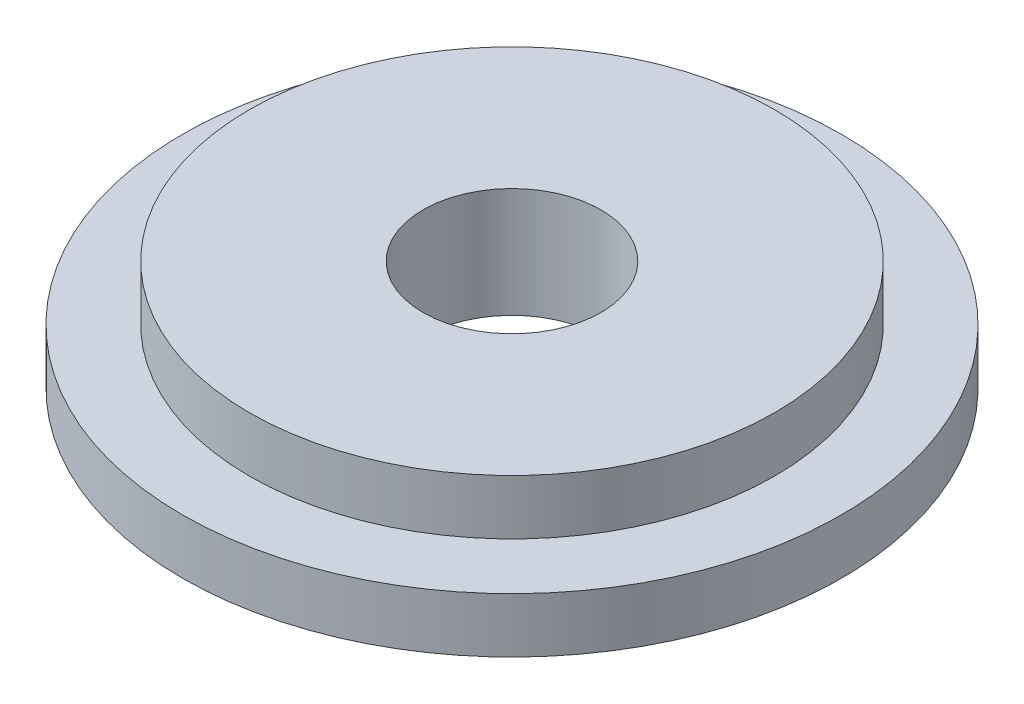
ISO-10303-21;
HEADER;
FILE_DESCRIPTION(('STEP AP214'),'2;1');
FILE_NAME('part.step','',(''),(''),'','','');
FILE_SCHEMA(('AUTOMOTIVE_DESIGN { 1 0 10303 214 1 1 1 1 }'));
ENDSEC;
DATA;
#1=APPLICATION_CONTEXT('core data for automotive mechanical design processes');
#2=APPLICATION_PROTOCOL_DEFINITION('international standard','automotive_design',2000,#1);
#3=PRODUCT_CONTEXT('',#1,'mechanical');
#4=PRODUCT('Part','Part','',(#3));
#5=PRODUCT_RELATED_PRODUCT_CATEGORY('part','',(#4));
#6=PRODUCT_DEFINITION_FORMATION('','',#4);
#7=PRODUCT_DEFINITION_CONTEXT('part definition',#1,'design');
#8=PRODUCT_DEFINITION('design','',#6,#7);
#9=PRODUCT_DEFINITION_SHAPE('','',#8);
#10=(LENGTH_UNIT() NAMED_UNIT(*) SI_UNIT(.MILLI.,.METRE.));
#11=(NAMED_UNIT(*) PLANE_ANGLE_UNIT() SI_UNIT($,.RADIAN.));
#12=(NAMED_UNIT(*) SI_UNIT($,.STERADIAN.) SOLID_ANGLE_UNIT());
#13=UNCERTAINTY_MEASURE_WITH_UNIT(LENGTH_MEASURE(1.E-05),#10,'distance_accuracy_value','');
#14=(GEOMETRIC_REPRESENTATION_CONTEXT(3) GLOBAL_UNCERTAINTY_ASSIGNED_CONTEXT((#13)) GLOBAL_UNIT_ASSIGNED_CONTEXT((#10,
#11,#12)) REPRESENTATION_CONTEXT('',''));
#15=CARTESIAN_POINT('',(0.,0.,0.));
#16=DIRECTION('',(0.,0.,1.));
#17=DIRECTION('',(1.,0.,0.));
#18=AXIS2_PLACEMENT_3D('',#15,#16,#17);
#19=CARTESIAN_POINT('',(0.,5.,0.));
#20=DIRECTION('',(0.,-1.,0.));
#21=DIRECTION('',(0.,0.,-1.));
#22=AXIS2_PLACEMENT_3D('',#19,#20,#21);
#23=CYLINDRICAL_SURFACE('',#22,8.1);
#24=CARTESIAN_POINT('',(0.,5.,0.));
#25=DIRECTION('',(0.,1.,0.));
#26=DIRECTION('',(0.,0.,1.));
#27=AXIS2_PLACEMENT_3D('',#24,#25,#26);
#28=CIRCLE('',#27,8.1);
#29=CARTESIAN_POINT('',(0.,5.,8.1));
#30=VERTEX_POINT('',#29);
#31=EDGE_CURVE('E48',#30,#30,#28,.T.);
#32=ORIENTED_EDGE('',*,*,#31,.T.);
#33=EDGE_LOOP('',(#32));
#34=FACE_BOUND('',#33,.T.);
#35=CARTESIAN_POINT('',(0.,-5.,0.));
#36=DIRECTION('',(0.,1.,0.));
#37=DIRECTION('',(0.,0.,1.));
#38=AXIS2_PLACEMENT_3D('',#35,#36,#37);
#39=CIRCLE('',#38,8.1);
#40=CARTESIAN_POINT('',(0.,-5.,8.1));
#41=VERTEX_POINT('',#40);
#42=EDGE_CURVE('E58',#41,#41,#39,.T.);
#43=ORIENTED_EDGE('',*,*,#42,.F.);
#44=EDGE_LOOP('',(#43));
#45=FACE_BOUND('',#44,.T.);
#46=ADVANCED_FACE('F41',(#34,#45),#23,.F.);
#47=CARTESIAN_POINT('',(0.,5.,0.));
#48=DIRECTION('',(0.,-1.,0.));
#49=DIRECTION('',(0.,0.,-1.));
#50=AXIS2_PLACEMENT_3D('',#47,#48,#49);
#51=CYLINDRICAL_SURFACE('',#50,23.9);
#52=CARTESIAN_POINT('',(0.,5.,0.));
#53=DIRECTION('',(0.,1.,0.));
#54=DIRECTION('',(0.,0.,1.));
#55=AXIS2_PLACEMENT_3D('',#52,#53,#54);
#56=CIRCLE('',#55,23.9);
#57=CARTESIAN_POINT('',(0.,5.,23.9));
#58=VERTEX_POINT('',#57);
#59=EDGE_CURVE('E10',#58,#58,#56,.T.);
#60=ORIENTED_EDGE('',*,*,#59,.F.);
#61=EDGE_LOOP('',(#60));
#62=FACE_BOUND('',#61,.T.);
#63=CARTESIAN_POINT('',(0.,0.,0.));
#64=DIRECTION('',(0.,1.,0.));
#65=DIRECTION('',(0.,0.,1.));
#66=AXIS2_PLACEMENT_3D('',#63,#64,#65);
#67=CIRCLE('',#66,23.9);
#68=CARTESIAN_POINT('',(0.,0.,23.9));
#69=VERTEX_POINT('',#68);
#70=EDGE_CURVE('E44',#69,#69,#67,.T.);
#71=ORIENTED_EDGE('',*,*,#70,.T.);
#72=EDGE_LOOP('',(#71));
#73=FACE_BOUND('',#72,.T.);
#74=ADVANCED_FACE('F75',(#62,#73),#51,.T.);
#75=CARTESIAN_POINT('',(0.,5.,0.));
#76=DIRECTION('',(0.,1.,0.));
#77=DIRECTION('',(0.,0.,1.));
#78=AXIS2_PLACEMENT_3D('',#75,#76,#77);
#79=PLANE('',#78);
#80=ORIENTED_EDGE('',*,*,#31,.F.);
#81=EDGE_LOOP('',(#80));
#82=FACE_BOUND('',#81,.T.);
#83=ORIENTED_EDGE('',*,*,#59,.T.);
#84=EDGE_LOOP('',(#83));
#85=FACE_BOUND('',#84,.T.);
#86=ADVANCED_FACE('F82',(#82,#85),#79,.T.);
#87=CARTESIAN_POINT('',(0.,-5.,0.));
#88=DIRECTION('',(0.,1.,0.));
#89=DIRECTION('',(0.,0.,1.));
#90=AXIS2_PLACEMENT_3D('',#87,#88,#89);
#91=CYLINDRICAL_SURFACE('',#90,30.);
#92=CARTESIAN_POINT('',(0.,-5.,0.));
#93=DIRECTION('',(0.,1.,0.));
#94=DIRECTION('',(0.,0.,1.));
#95=AXIS2_PLACEMENT_3D('',#92,#93,#94);
#96=CIRCLE('',#95,30.);
#97=CARTESIAN_POINT('',(0.,-5.,30.));
#98=VERTEX_POINT('',#97);
#99=EDGE_CURVE('E57',#98,#98,#96,.T.);
#100=ORIENTED_EDGE('',*,*,#99,.T.);
#101=EDGE_LOOP('',(#100));
#102=FACE_BOUND('',#101,.T.);
#103=CARTESIAN_POINT('',(0.,0.,0.));
#104=DIRECTION('',(0.,1.,0.));
#105=DIRECTION('',(0.,0.,1.));
#106=AXIS2_PLACEMENT_3D('',#103,#104,#105);
#107=CIRCLE('',#106,30.);
#108=CARTESIAN_POINT('',(0.,0.,30.));
#109=VERTEX_POINT('',#108);
#110=EDGE_CURVE('E54',#109,#109,#107,.T.);
#111=ORIENTED_EDGE('',*,*,#110,.F.);
#112=EDGE_LOOP('',(#111));
#113=FACE_BOUND('',#112,.T.);
#114=ADVANCED_FACE('F64',(#102,#113),#91,.T.);
#115=CARTESIAN_POINT('',(0.,-5.,0.));
#116=DIRECTION('',(0.,1.,0.));
#117=DIRECTION('',(0.,0.,1.));
#118=AXIS2_PLACEMENT_3D('',#115,#116,#117);
#119=PLANE('',#118);
#120=ORIENTED_EDGE('',*,*,#99,.F.);
#121=EDGE_LOOP('',(#120));
#122=FACE_BOUND('',#121,.T.);
#123=ORIENTED_EDGE('',*,*,#42,.T.);
#124=EDGE_LOOP('',(#123));
#125=FACE_BOUND('',#124,.T.);
#126=ADVANCED_FACE('F67',(#122,#125),#119,.F.);
#127=CARTESIAN_POINT('',(0.,0.,0.));
#128=DIRECTION('',(0.,1.,0.));
#129=DIRECTION('',(0.,0.,1.));
#130=AXIS2_PLACEMENT_3D('',#127,#128,#129);
#131=PLANE('',#130);
#132=ORIENTED_EDGE('',*,*,#70,.F.);
#133=EDGE_LOOP('',(#132));
#134=FACE_BOUND('',#133,.T.);
#135=ORIENTED_EDGE('',*,*,#110,.T.);
#136=EDGE_LOOP('',(#135));
#137=FACE_BOUND('',#136,.T.);
#138=ADVANCED_FACE('F70',(#134,#137),#131,.T.);
#139=CLOSED_SHELL('',(#46,#74,#86,#114,#126,#138));
#140=MANIFOLD_SOLID_BREP('B2',#139);
#141=ADVANCED_BREP_SHAPE_REPRESENTATION('',(#18,#140),#14);
#142=SHAPE_DEFINITION_REPRESENTATION(#9,#141);
ENDSEC;
END-ISO-10303-21;
